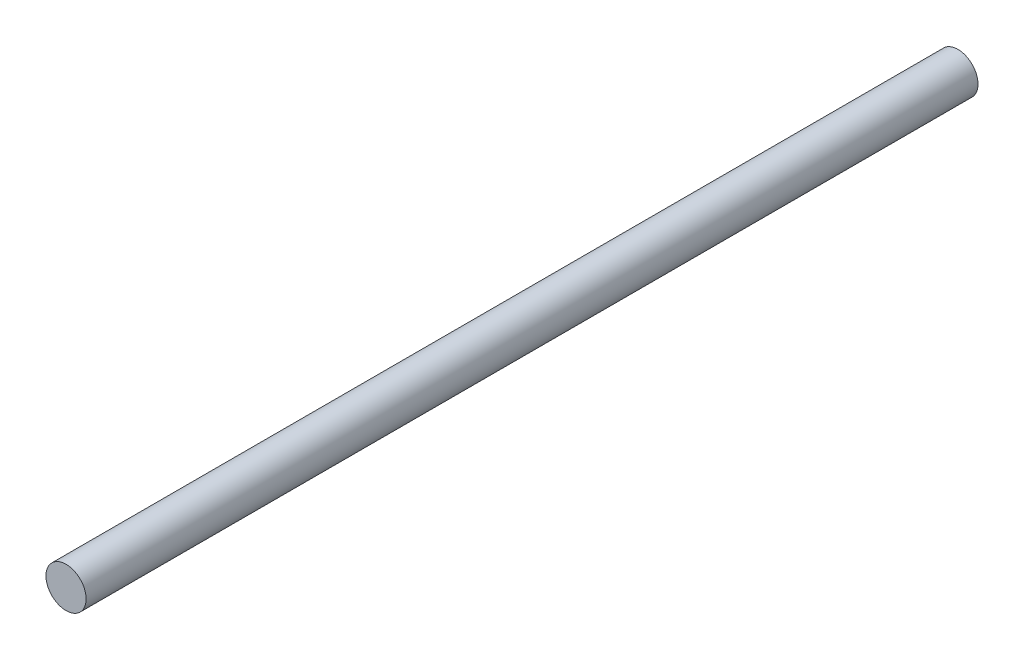
ISO-10303-21;
HEADER;
FILE_DESCRIPTION(('STEP AP214'),'2;1');
FILE_NAME('part.step','',(''),(''),'','','');
FILE_SCHEMA(('AUTOMOTIVE_DESIGN { 1 0 10303 214 1 1 1 1 }'));
ENDSEC;
DATA;
#1=APPLICATION_CONTEXT('core data for automotive mechanical design processes');
#2=APPLICATION_PROTOCOL_DEFINITION('international standard','automotive_design',2000,#1);
#3=PRODUCT_CONTEXT('',#1,'mechanical');
#4=PRODUCT('Part','Part','',(#3));
#5=PRODUCT_RELATED_PRODUCT_CATEGORY('part','',(#4));
#6=PRODUCT_DEFINITION_FORMATION('','',#4);
#7=PRODUCT_DEFINITION_CONTEXT('part definition',#1,'design');
#8=PRODUCT_DEFINITION('design','',#6,#7);
#9=PRODUCT_DEFINITION_SHAPE('','',#8);
#10=(LENGTH_UNIT() NAMED_UNIT(*) SI_UNIT(.MILLI.,.METRE.));
#11=(NAMED_UNIT(*) PLANE_ANGLE_UNIT() SI_UNIT($,.RADIAN.));
#12=(NAMED_UNIT(*) SI_UNIT($,.STERADIAN.) SOLID_ANGLE_UNIT());
#13=UNCERTAINTY_MEASURE_WITH_UNIT(LENGTH_MEASURE(1.E-05),#10,'distance_accuracy_value','');
#14=(GEOMETRIC_REPRESENTATION_CONTEXT(3) GLOBAL_UNCERTAINTY_ASSIGNED_CONTEXT((#13)) GLOBAL_UNIT_ASSIGNED_CONTEXT((#10,
#11,#12)) REPRESENTATION_CONTEXT('',''));
#15=CARTESIAN_POINT('',(0.,0.,0.));
#16=DIRECTION('',(0.,0.,1.));
#17=DIRECTION('',(1.,0.,0.));
#18=AXIS2_PLACEMENT_3D('',#15,#16,#17);
#19=CARTESIAN_POINT('',(0.,0.,111.));
#20=DIRECTION('',(0.,0.,-1.));
#21=DIRECTION('',(-1.,0.,0.));
#22=AXIS2_PLACEMENT_3D('',#19,#20,#21);
#23=CYLINDRICAL_SURFACE('',#22,2.5);
#24=CARTESIAN_POINT('',(0.,0.,111.));
#25=DIRECTION('',(0.,0.,1.));
#26=DIRECTION('',(1.,0.,0.));
#27=AXIS2_PLACEMENT_3D('',#24,#25,#26);
#28=CIRCLE('',#27,2.5);
#29=CARTESIAN_POINT('',(2.5,0.,111.));
#30=VERTEX_POINT('',#29);
#31=EDGE_CURVE('E10',#30,#30,#28,.T.);
#32=ORIENTED_EDGE('',*,*,#31,.F.);
#33=EDGE_LOOP('',(#32));
#34=FACE_BOUND('',#33,.T.);
#35=CARTESIAN_POINT('',(0.,0.,0.));
#36=DIRECTION('',(0.,0.,1.));
#37=DIRECTION('',(1.,0.,0.));
#38=AXIS2_PLACEMENT_3D('',#35,#36,#37);
#39=CIRCLE('',#38,2.5);
#40=CARTESIAN_POINT('',(2.5,0.,0.));
#41=VERTEX_POINT('',#40);
#42=EDGE_CURVE('E37',#41,#41,#39,.T.);
#43=ORIENTED_EDGE('',*,*,#42,.T.);
#44=EDGE_LOOP('',(#43));
#45=FACE_BOUND('',#44,.T.);
#46=ADVANCED_FACE('F34',(#34,#45),#23,.T.);
#47=CARTESIAN_POINT('',(0.,0.,111.));
#48=DIRECTION('',(0.,0.,1.));
#49=DIRECTION('',(1.,0.,0.));
#50=AXIS2_PLACEMENT_3D('',#47,#48,#49);
#51=PLANE('',#50);
#52=ORIENTED_EDGE('',*,*,#31,.T.);
#53=EDGE_LOOP('',(#52));
#54=FACE_BOUND('',#53,.T.);
#55=ADVANCED_FACE('F49',(#54),#51,.T.);
#56=CARTESIAN_POINT('',(0.,0.,0.));
#57=DIRECTION('',(0.,0.,1.));
#58=DIRECTION('',(1.,0.,0.));
#59=AXIS2_PLACEMENT_3D('',#56,#57,#58);
#60=PLANE('',#59);
#61=ORIENTED_EDGE('',*,*,#42,.F.);
#62=EDGE_LOOP('',(#61));
#63=FACE_BOUND('',#62,.T.);
#64=ADVANCED_FACE('F47',(#63),#60,.F.);
#65=CLOSED_SHELL('',(#46,#55,#64));
#66=MANIFOLD_SOLID_BREP('B2',#65);
#67=ADVANCED_BREP_SHAPE_REPRESENTATION('',(#18,#66),#14);
#68=SHAPE_DEFINITION_REPRESENTATION(#9,#67);
ENDSEC;
END-ISO-10303-21;
